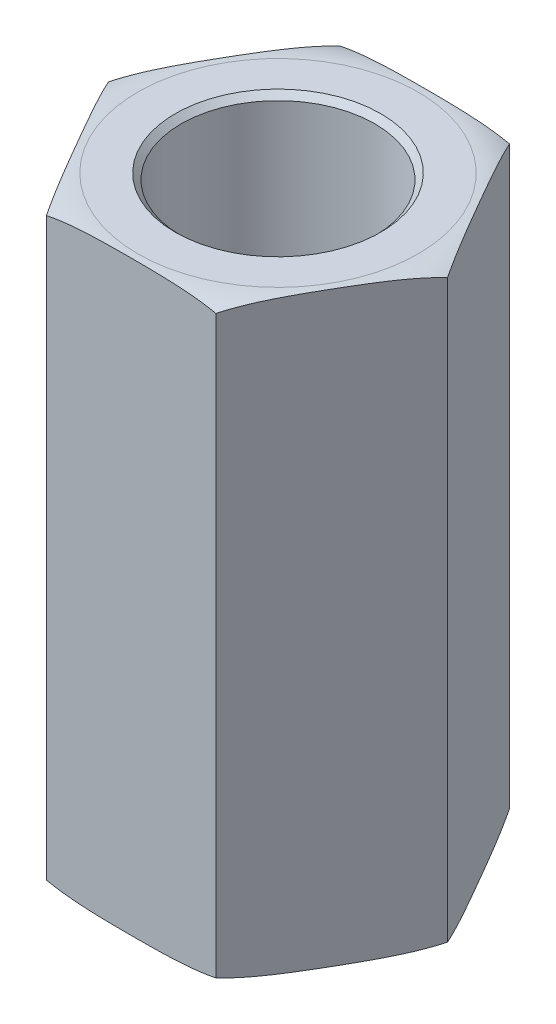
ISO-10303-21;
HEADER;
FILE_DESCRIPTION(('STEP AP214'),'2;1');
FILE_NAME('part.step','',(''),(''),'','','');
FILE_SCHEMA(('AUTOMOTIVE_DESIGN { 1 0 10303 214 1 1 1 1 }'));
ENDSEC;
DATA;
#1=APPLICATION_CONTEXT('core data for automotive mechanical design processes');
#2=APPLICATION_PROTOCOL_DEFINITION('international standard','automotive_design',2000,#1);
#3=PRODUCT_CONTEXT('',#1,'mechanical');
#4=PRODUCT('Part','Part','',(#3));
#5=PRODUCT_RELATED_PRODUCT_CATEGORY('part','',(#4));
#6=PRODUCT_DEFINITION_FORMATION('','',#4);
#7=PRODUCT_DEFINITION_CONTEXT('part definition',#1,'design');
#8=PRODUCT_DEFINITION('design','',#6,#7);
#9=PRODUCT_DEFINITION_SHAPE('','',#8);
#10=(LENGTH_UNIT() NAMED_UNIT(*) SI_UNIT(.MILLI.,.METRE.));
#11=(NAMED_UNIT(*) PLANE_ANGLE_UNIT() SI_UNIT($,.RADIAN.));
#12=(NAMED_UNIT(*) SI_UNIT($,.STERADIAN.) SOLID_ANGLE_UNIT());
#13=UNCERTAINTY_MEASURE_WITH_UNIT(LENGTH_MEASURE(1.E-05),#10,'distance_accuracy_value','');
#14=(GEOMETRIC_REPRESENTATION_CONTEXT(3) GLOBAL_UNCERTAINTY_ASSIGNED_CONTEXT((#13)) GLOBAL_UNIT_ASSIGNED_CONTEXT((#10,
#11,#12)) REPRESENTATION_CONTEXT('',''));
#15=CARTESIAN_POINT('',(0.,0.,0.));
#16=DIRECTION('',(0.,0.,1.));
#17=DIRECTION('',(1.,0.,0.));
#18=AXIS2_PLACEMENT_3D('',#15,#16,#17);
#19=CARTESIAN_POINT('',(3.66617420935412,6.35,0.));
#20=DIRECTION('',(-0.866025403784439,0.,0.5));
#21=DIRECTION('',(0.5,0.,0.866025403784439));
#22=AXIS2_PLACEMENT_3D('',#19,#20,#21);
#23=PLANE('',#22);
#24=CARTESIAN_POINT('',(3.66617420935412,6.223,0.));
#25=CARTESIAN_POINT('',(3.63753042799203,6.23493202468709,-0.0496124846400273));
#26=CARTESIAN_POINT('',(3.60875945805375,6.24555614694223,-0.0994452663561575));
#27=CARTESIAN_POINT('',(3.5510445941875,6.26452869380446,-0.199410342924434));
#28=CARTESIAN_POINT('',(3.52210079717004,6.27287829008084,-0.249542469922636));
#29=CARTESIAN_POINT('',(3.43520914920621,6.29501015084215,-0.400043218949385));
#30=CARTESIAN_POINT('',(3.37708055050429,6.30592253839952,-0.500724905273883));
#31=CARTESIAN_POINT('',(3.26070078255249,6.3225474670846,-0.70230057633948));
#32=CARTESIAN_POINT('',(3.20244972255356,6.32826351393611,-0.803194371852365));
#33=CARTESIAN_POINT('',(3.08586365366197,6.33654325238667,-1.00512736662734));
#34=CARTESIAN_POINT('',(3.02752861562773,6.3391051045623,-1.1061666163641));
#35=CARTESIAN_POINT('',(2.9113821383228,6.3424800878033,-1.30733821617637));
#36=CARTESIAN_POINT('',(2.85357078573452,6.34330898530758,-1.40747041611356));
#37=CARTESIAN_POINT('',(2.73795502274299,6.34390235146376,-1.60772279177073));
#38=CARTESIAN_POINT('',(2.68015061252641,6.34366697200316,-1.70784296716739));
#39=CARTESIAN_POINT('',(2.5645271384304,6.34193398748164,-1.90810869884931));
#40=CARTESIAN_POINT('',(2.50670807591217,6.34043597123025,-2.0082542527769));
#41=CARTESIAN_POINT('',(2.39109525560101,6.33517531674577,-2.20850153156215));
#42=CARTESIAN_POINT('',(2.33330149587797,6.33141290136093,-2.30860325976288));
#43=CARTESIAN_POINT('',(2.23849359853911,6.32198899303816,-2.47281535491257));
#44=CARTESIAN_POINT('',(2.20145192539195,6.31749057663767,-2.53697341480081));
#45=CARTESIAN_POINT('',(2.12747060706784,6.30630148199487,-2.66511281694908));
#46=CARTESIAN_POINT('',(2.09053091530161,6.2996120720916,-2.72909423990413));
#47=CARTESIAN_POINT('',(2.01669860633929,6.28339780386583,-2.85697555026699));
#48=CARTESIAN_POINT('',(1.97980639337021,6.27386525006224,-2.92087473753309));
#49=CARTESIAN_POINT('',(1.90623831426152,6.25126291445617,-3.04829838836459));
#50=CARTESIAN_POINT('',(1.86956287153406,6.23818767878213,-3.11182211855863));
#51=CARTESIAN_POINT('',(1.83308710467706,6.223,-3.175));
#52=B_SPLINE_CURVE_WITH_KNOTS('',3,(#24,#25,#26,#27,#28,#29,#30,#31,#32,#33,#34,#35,#36,#37,#38,
#39,#40,#41,#42,#43,#44,#45,#46,#47,#48,#49,#50,#51),.UNSPECIFIED.,.F.,.F.,(4,2,2,2,2,2,2,2,2,2,
2,2,2,4),(0.,0.17550946738822,0.350928353443244,0.701031261588485,1.05089779629355,
1.40096826525493,1.74783967758032,2.09466158796882,2.44159648808704,2.78849725058545,
3.01113198199941,3.23363806003512,3.45675194236245,3.68021127402553),.UNSPECIFIED.);
#53=CARTESIAN_POINT('',(3.66617420935412,6.223,0.));
#54=VERTEX_POINT('',#53);
#55=CARTESIAN_POINT('',(1.83308710467706,6.223,-3.175));
#56=VERTEX_POINT('',#55);
#57=EDGE_CURVE('E107',#54,#56,#52,.T.);
#58=ORIENTED_EDGE('',*,*,#57,.F.);
#59=DIRECTION('',(0.,1.,0.));
#60=VECTOR('',#59,1.);
#61=CARTESIAN_POINT('',(3.66617420935412,6.35,0.));
#62=LINE('',#61,#60);
#63=CARTESIAN_POINT('',(3.66617420935412,-6.223,0.));
#64=VERTEX_POINT('',#63);
#65=EDGE_CURVE('E80',#54,#64,#62,.F.);
#66=ORIENTED_EDGE('',*,*,#65,.T.);
#67=CARTESIAN_POINT('',(1.83308710467705,-6.223,-3.17500000000001));
#68=CARTESIAN_POINT('',(1.86173088603914,-6.23493202468708,-3.12538751535998));
#69=CARTESIAN_POINT('',(1.89050185597742,-6.24555614694223,-3.07555473364384));
#70=CARTESIAN_POINT('',(1.94821671984368,-6.26452869380445,-2.97558965707556));
#71=CARTESIAN_POINT('',(1.97716051686114,-6.27287829008084,-2.92545753007736));
#72=CARTESIAN_POINT('',(2.06405216482497,-6.29501015084215,-2.77495678105061));
#73=CARTESIAN_POINT('',(2.12218076352689,-6.30592253839952,-2.67427509472611));
#74=CARTESIAN_POINT('',(2.2385605314787,-6.3225474670846,-2.4726994236605));
#75=CARTESIAN_POINT('',(2.29681159147762,-6.32826351393611,-2.37180562814761));
#76=CARTESIAN_POINT('',(2.41339766036922,-6.33654325238667,-2.16987263337264));
#77=CARTESIAN_POINT('',(2.47173269840347,-6.3391051045623,-2.06883338363586));
#78=CARTESIAN_POINT('',(2.58787917570839,-6.3424800878033,-1.86766178382359));
#79=CARTESIAN_POINT('',(2.64569052829668,-6.34330898530758,-1.7675295838864));
#80=CARTESIAN_POINT('',(2.76130629128821,-6.34390235146376,-1.56727720822922));
#81=CARTESIAN_POINT('',(2.81911070150479,-6.34366697200316,-1.46715703283255));
#82=CARTESIAN_POINT('',(2.93473417560081,-6.34193398748164,-1.26689130115063));
#83=CARTESIAN_POINT('',(2.99255323811904,-6.34043597123025,-1.16674574722304));
#84=CARTESIAN_POINT('',(3.1081660584302,-6.33517531674576,-0.966498468437779));
#85=CARTESIAN_POINT('',(3.16595981815325,-6.33141290136092,-0.866396740237043));
#86=CARTESIAN_POINT('',(3.26076771549211,-6.32198899303815,-0.702184645087361));
#87=CARTESIAN_POINT('',(3.29780938863927,-6.31749057663767,-0.638026585199124));
#88=CARTESIAN_POINT('',(3.37179070696336,-6.30630148199486,-0.509887183050866));
#89=CARTESIAN_POINT('',(3.40873039872959,-6.2996120720916,-0.445905760095823));
#90=CARTESIAN_POINT('',(3.4825627076919,-6.28339780386583,-0.318024449732975));
#91=CARTESIAN_POINT('',(3.51945492066098,-6.27386525006224,-0.254125262466882));
#92=CARTESIAN_POINT('',(3.59302299976966,-6.25126291445617,-0.126701611635399));
#93=CARTESIAN_POINT('',(3.62969844249711,-6.23818767878213,-0.0631778814413663));
#94=CARTESIAN_POINT('',(3.66617420935412,-6.223,0.));
#95=B_SPLINE_CURVE_WITH_KNOTS('',3,(#67,#68,#69,#70,#71,#72,#73,#74,#75,#76,#77,#78,#79,#80,#81,
#82,#83,#84,#85,#86,#87,#88,#89,#90,#91,#92,#93,#94),.UNSPECIFIED.,.F.,.F.,(4,2,2,2,2,2,2,2,2,2,
2,2,2,4),(0.,0.175509467388227,0.350928353443257,0.701031261588509,1.05089779629358,
1.40096826525498,1.74783967758038,2.09466158796889,2.44159648808712,2.78849725058554,
3.01113198199948,3.23363806003517,3.45675194236248,3.68021127402553),.UNSPECIFIED.);
#96=CARTESIAN_POINT('',(1.83308710467705,-6.223,-3.175));
#97=VERTEX_POINT('',#96);
#98=EDGE_CURVE('E97',#97,#64,#95,.T.);
#99=ORIENTED_EDGE('',*,*,#98,.F.);
#100=DIRECTION('',(0.,1.,0.));
#101=VECTOR('',#100,1.);
#102=CARTESIAN_POINT('',(1.83308710467704,6.35,-3.175));
#103=LINE('',#102,#101);
#104=EDGE_CURVE('E111',#97,#56,#103,.T.);
#105=ORIENTED_EDGE('',*,*,#104,.T.);
#106=EDGE_LOOP('',(#58,#66,#99,#105));
#107=FACE_BOUND('',#106,.T.);
#108=ADVANCED_FACE('F17',(#107),#23,.F.);
#109=CARTESIAN_POINT('',(1.83308710467706,6.35,3.17499999999999));
#110=DIRECTION('',(-0.866025403784439,0.,-0.5));
#111=DIRECTION('',(-0.5,0.,0.866025403784439));
#112=AXIS2_PLACEMENT_3D('',#109,#110,#111);
#113=PLANE('',#112);
#114=CARTESIAN_POINT('',(1.83308710467706,6.223,3.17499999999999));
#115=CARTESIAN_POINT('',(1.86173088603915,6.23493202468709,3.12538751535996));
#116=CARTESIAN_POINT('',(1.89050185597743,6.24555614694223,3.07555473364383));
#117=CARTESIAN_POINT('',(1.94821671984368,6.26452869380446,2.97558965707556));
#118=CARTESIAN_POINT('',(1.97716051686114,6.27287829008084,2.92545753007736));
#119=CARTESIAN_POINT('',(2.06405216482498,6.29501015084215,2.77495678105061));
#120=CARTESIAN_POINT('',(2.12218076352689,6.30592253839952,2.67427509472611));
#121=CARTESIAN_POINT('',(2.23856053147869,6.3225474670846,2.47269942366051));
#122=CARTESIAN_POINT('',(2.29681159147762,6.32826351393611,2.37180562814763));
#123=CARTESIAN_POINT('',(2.41339766036922,6.33654325238667,2.16987263337266));
#124=CARTESIAN_POINT('',(2.47173269840346,6.3391051045623,2.06883338363589));
#125=CARTESIAN_POINT('',(2.58787917570838,6.3424800878033,1.86766178382362));
#126=CARTESIAN_POINT('',(2.64569052829666,6.34330898530758,1.76752958388643));
#127=CARTESIAN_POINT('',(2.76130629128819,6.34390235146376,1.56727720822926));
#128=CARTESIAN_POINT('',(2.81911070150477,6.34366697200316,1.46715703283259));
#129=CARTESIAN_POINT('',(2.93473417560078,6.34193398748164,1.26689130115068));
#130=CARTESIAN_POINT('',(2.99255323811902,6.34043597123025,1.16674574722309));
#131=CARTESIAN_POINT('',(3.10816605843017,6.33517531674577,0.966498468437838));
#132=CARTESIAN_POINT('',(3.16595981815321,6.33141290136093,0.866396740237105));
#133=CARTESIAN_POINT('',(3.26076771549208,6.32198899303816,0.702184645087422));
#134=CARTESIAN_POINT('',(3.29780938863924,6.31749057663767,0.638026585199181));
#135=CARTESIAN_POINT('',(3.37179070696334,6.30630148199487,0.509887183050912));
#136=CARTESIAN_POINT('',(3.40873039872957,6.2996120720916,0.445905760095864));
#137=CARTESIAN_POINT('',(3.48256270769189,6.28339780386583,0.318024449733006));
#138=CARTESIAN_POINT('',(3.51945492066097,6.27386525006224,0.254125262466908));
#139=CARTESIAN_POINT('',(3.59302299976965,6.25126291445617,0.126701611635414));
#140=CARTESIAN_POINT('',(3.62969844249711,6.23818767878213,0.0631778814413764));
#141=CARTESIAN_POINT('',(3.66617420935412,6.223,0.));
#142=B_SPLINE_CURVE_WITH_KNOTS('',3,(#114,#115,#116,#117,#118,#119,#120,#121,#122,#123,#124,
#125,#126,#127,#128,#129,#130,#131,#132,#133,#134,#135,#136,#137,#138,#139,#140,#141),
.UNSPECIFIED.,.F.,.F.,(4,2,2,2,2,2,2,2,2,2,2,2,2,4),(0.,0.175509467388221,0.350928353443245,
0.701031261588486,1.05089779629355,1.40096826525493,1.74783967758032,2.09466158796882,
2.44159648808704,2.78849725058545,3.0111319819994,3.23363806003511,3.45675194236244,
3.68021127402551),.UNSPECIFIED.);
#143=CARTESIAN_POINT('',(1.83308710467706,6.223,3.17499999999999));
#144=VERTEX_POINT('',#143);
#145=EDGE_CURVE('E22',#144,#54,#142,.T.);
#146=ORIENTED_EDGE('',*,*,#145,.F.);
#147=DIRECTION('',(0.,1.,0.));
#148=VECTOR('',#147,1.);
#149=CARTESIAN_POINT('',(1.83308710467706,6.35,3.17499999999999));
#150=LINE('',#149,#148);
#151=CARTESIAN_POINT('',(1.83308710467706,-6.223,3.17499999999999));
#152=VERTEX_POINT('',#151);
#153=EDGE_CURVE('E100',#144,#152,#150,.F.);
#154=ORIENTED_EDGE('',*,*,#153,.T.);
#155=CARTESIAN_POINT('',(3.66617420935412,-6.223,0.));
#156=CARTESIAN_POINT('',(3.63753042799203,-6.23493202468709,0.0496124846400355));
#157=CARTESIAN_POINT('',(3.60875945805375,-6.24555614694223,0.0994452663561683));
#158=CARTESIAN_POINT('',(3.55104459418749,-6.26452869380446,0.19941034292445));
#159=CARTESIAN_POINT('',(3.52210079717003,-6.27287829008084,0.249542469922655));
#160=CARTESIAN_POINT('',(3.43520914920619,-6.29501015084215,0.400043218949413));
#161=CARTESIAN_POINT('',(3.37708055050427,-6.30592253839952,0.500724905273916));
#162=CARTESIAN_POINT('',(3.26070078255247,-6.3225474670846,0.702300576339523));
#163=CARTESIAN_POINT('',(3.20244972255354,-6.32826351393611,0.803194371852414));
#164=CARTESIAN_POINT('',(3.08586365366193,-6.33654325238667,1.0051273666274));
#165=CARTESIAN_POINT('',(3.02752861562769,-6.3391051045623,1.10616661636417));
#166=CARTESIAN_POINT('',(2.91138213832276,-6.3424800878033,1.30733821617645));
#167=CARTESIAN_POINT('',(2.85357078573448,-6.34330898530758,1.40747041611364));
#168=CARTESIAN_POINT('',(2.73795502274294,-6.34390235146376,1.60772279177082));
#169=CARTESIAN_POINT('',(2.68015061252636,-6.34366697200316,1.70784296716749));
#170=CARTESIAN_POINT('',(2.56452713843034,-6.34193398748164,1.90810869884942));
#171=CARTESIAN_POINT('',(2.5067080759121,-6.34043597123025,2.00825425277701));
#172=CARTESIAN_POINT('',(2.39109525560094,-6.33517531674576,2.20850153156228));
#173=CARTESIAN_POINT('',(2.3333014958779,-6.33141290136092,2.30860325976302));
#174=CARTESIAN_POINT('',(2.23849359853904,-6.32198899303815,2.47281535491269));
#175=CARTESIAN_POINT('',(2.20145192539188,-6.31749057663766,2.53697341480092));
#176=CARTESIAN_POINT('',(2.1274706070678,-6.30630148199486,2.66511281694917));
#177=CARTESIAN_POINT('',(2.09053091530157,-6.29961207209159,2.72909423990421));
#178=CARTESIAN_POINT('',(2.01669860633926,-6.28339780386582,2.85697555026704));
#179=CARTESIAN_POINT('',(1.97980639337019,-6.27386525006223,2.92087473753313));
#180=CARTESIAN_POINT('',(1.90623831426151,-6.25126291445617,3.0482983883646));
#181=CARTESIAN_POINT('',(1.86956287153406,-6.23818767878213,3.11182211855863));
#182=CARTESIAN_POINT('',(1.83308710467706,-6.223,3.17499999999999));
#183=B_SPLINE_CURVE_WITH_KNOTS('',3,(#155,#156,#157,#158,#159,#160,#161,#162,#163,#164,#165,
#166,#167,#168,#169,#170,#171,#172,#173,#174,#175,#176,#177,#178,#179,#180,#181,#182),
.UNSPECIFIED.,.F.,.F.,(4,2,2,2,2,2,2,2,2,2,2,2,2,4),(0.,0.17550946738823,0.350928353443263,
0.701031261588523,1.0508977962936,1.40096826525501,1.74783967758041,2.09466158796894,
2.44159648808717,2.7884972505856,3.01113198199951,3.23363806003518,3.45675194236248,
3.68021127402551),.UNSPECIFIED.);
#184=EDGE_CURVE('E205',#64,#152,#183,.T.);
#185=ORIENTED_EDGE('',*,*,#184,.F.);
#186=ORIENTED_EDGE('',*,*,#65,.F.);
#187=EDGE_LOOP('',(#146,#154,#185,#186));
#188=FACE_BOUND('',#187,.T.);
#189=ADVANCED_FACE('F106',(#188),#113,.F.);
#190=CARTESIAN_POINT('',(-1.83308710467707,6.35,3.175));
#191=DIRECTION('',(0.,0.,-1.));
#192=DIRECTION('',(-1.,0.,0.));
#193=AXIS2_PLACEMENT_3D('',#190,#191,#192);
#194=PLANE('',#193);
#195=ORIENTED_EDGE('',*,*,#153,.F.);
#196=CARTESIAN_POINT('',(-1.83308710467707,6.223,3.175));
#197=CARTESIAN_POINT('',(-1.75760871054776,6.23871230122365,3.175));
#198=CARTESIAN_POINT('',(-1.68170571468658,6.2521647800808,3.175));
#199=CARTESIAN_POINT('',(-1.52939807527773,6.27530486470105,3.175));
#200=CARTESIAN_POINT('',(-1.45299400110163,6.28499617502722,3.175));
#201=CARTESIAN_POINT('',(-1.30011823209763,6.30137135267138,3.175));
#202=CARTESIAN_POINT('',(-1.22364747610196,6.30806442247852,3.175));
#203=CARTESIAN_POINT('',(-1.07052459410173,6.31917241699752,3.175));
#204=CARTESIAN_POINT('',(-0.993872424115957,6.32358671655425,3.175));
#205=CARTESIAN_POINT('',(-0.840856910195846,6.33072419802798,3.175));
#206=CARTESIAN_POINT('',(-0.764493913329282,6.33345527367792,3.175));
#207=CARTESIAN_POINT('',(-0.611734616938516,6.33775632258003,3.175));
#208=CARTESIAN_POINT('',(-0.535338316331409,6.33932625473883,3.175));
#209=CARTESIAN_POINT('',(-0.38245423122642,6.34168247076567,3.175));
#210=CARTESIAN_POINT('',(-0.305966435115039,6.34246792759644,3.175));
#211=CARTESIAN_POINT('',(-0.152985759387013,6.34348841069004,3.175));
#212=CARTESIAN_POINT('',(-0.0764928796935063,6.3437234241492,3.175));
#213=CARTESIAN_POINT('',(0.0764928796935061,6.3437234241492,3.175));
#214=CARTESIAN_POINT('',(0.152985759387012,6.34348841069004,3.17499999999999));
#215=CARTESIAN_POINT('',(0.305966435115038,6.34246792759644,3.17499999999999));
#216=CARTESIAN_POINT('',(0.382454231226419,6.34168247076567,3.17499999999999));
#217=CARTESIAN_POINT('',(0.535338316331408,6.33932625473883,3.17499999999999));
#218=CARTESIAN_POINT('',(0.611734616938515,6.33775632258003,3.17499999999999));
#219=CARTESIAN_POINT('',(0.76449391332928,6.33345527367792,3.17499999999999));
#220=CARTESIAN_POINT('',(0.840856910195844,6.33072419802798,3.17499999999999));
#221=CARTESIAN_POINT('',(0.993872424115954,6.32358671655425,3.17499999999999));
#222=CARTESIAN_POINT('',(1.07052459410172,6.31917241699752,3.17499999999999));
#223=CARTESIAN_POINT('',(1.22364747610196,6.30806442247852,3.17499999999999));
#224=CARTESIAN_POINT('',(1.30011823209763,6.30137135267139,3.17499999999999));
#225=CARTESIAN_POINT('',(1.45299400110163,6.28499617502722,3.17499999999999));
#226=CARTESIAN_POINT('',(1.52939807527773,6.27530486470105,3.17499999999999));
#227=CARTESIAN_POINT('',(1.68170571468658,6.25216478008081,3.17499999999999));
#228=CARTESIAN_POINT('',(1.75760871054776,6.23871230122365,3.17499999999999));
#229=CARTESIAN_POINT('',(1.83308710467706,6.223,3.17499999999999));
#230=B_SPLINE_CURVE_WITH_KNOTS('',3,(#196,#197,#198,#199,#200,#201,#202,#203,#204,#205,#206,
#207,#208,#209,#210,#211,#212,#213,#214,#215,#216,#217,#218,#219,#220,#221,#222,#223,#224,#225,
#226,#227,#228,#229),.UNSPECIFIED.,.F.,.F.,(4,2,2,2,2,2,2,2,2,2,2,2,2,2,2,2,4),(0.,
0.23119079437731,0.46215329593589,0.692401964780505,0.922713766248053,1.15193709952408,
1.3811685447265,1.61064140410055,1.84011960111017,2.06959779811978,2.29907065749383,
2.52830210269625,2.75752543597228,2.98783723743982,3.21808590628444,3.44904840784302,
3.68023920222033),.UNSPECIFIED.);
#231=CARTESIAN_POINT('',(-1.83308710467707,6.223,3.175));
#232=VERTEX_POINT('',#231);
#233=EDGE_CURVE('E86',#232,#144,#230,.T.);
#234=ORIENTED_EDGE('',*,*,#233,.F.);
#235=DIRECTION('',(0.,1.,0.));
#236=VECTOR('',#235,1.);
#237=CARTESIAN_POINT('',(-1.83308710467707,6.35,3.175));
#238=LINE('',#237,#236);
#239=CARTESIAN_POINT('',(-1.83308710467707,-6.223,3.175));
#240=VERTEX_POINT('',#239);
#241=EDGE_CURVE('E104',#232,#240,#238,.F.);
#242=ORIENTED_EDGE('',*,*,#241,.T.);
#243=CARTESIAN_POINT('',(1.83308710467706,-6.223,3.17499999999999));
#244=CARTESIAN_POINT('',(1.75760871054776,-6.23871230122365,3.17499999999999));
#245=CARTESIAN_POINT('',(1.68170571468658,-6.25216478008081,3.17499999999999));
#246=CARTESIAN_POINT('',(1.52939807527773,-6.27530486470105,3.17499999999999));
#247=CARTESIAN_POINT('',(1.45299400110163,-6.28499617502722,3.17499999999999));
#248=CARTESIAN_POINT('',(1.30011823209763,-6.30137135267139,3.17499999999999));
#249=CARTESIAN_POINT('',(1.22364747610196,-6.30806442247852,3.17499999999999));
#250=CARTESIAN_POINT('',(1.07052459410172,-6.31917241699752,3.17499999999999));
#251=CARTESIAN_POINT('',(0.993872424115954,-6.32358671655425,3.17499999999999));
#252=CARTESIAN_POINT('',(0.840856910195844,-6.33072419802799,3.17499999999999));
#253=CARTESIAN_POINT('',(0.76449391332928,-6.33345527367792,3.17499999999999));
#254=CARTESIAN_POINT('',(0.611734616938515,-6.33775632258003,3.17499999999999));
#255=CARTESIAN_POINT('',(0.535338316331408,-6.33932625473883,3.17499999999999));
#256=CARTESIAN_POINT('',(0.382454231226419,-6.34168247076568,3.17499999999999));
#257=CARTESIAN_POINT('',(0.305966435115038,-6.34246792759644,3.17499999999999));
#258=CARTESIAN_POINT('',(0.152985759387012,-6.34348841069004,3.17499999999999));
#259=CARTESIAN_POINT('',(0.0764928796935062,-6.3437234241492,3.175));
#260=CARTESIAN_POINT('',(-0.076492879693506,-6.3437234241492,3.175));
#261=CARTESIAN_POINT('',(-0.152985759387012,-6.34348841069004,3.175));
#262=CARTESIAN_POINT('',(-0.305966435115038,-6.34246792759644,3.175));
#263=CARTESIAN_POINT('',(-0.382454231226419,-6.34168247076568,3.175));
#264=CARTESIAN_POINT('',(-0.535338316331408,-6.33932625473883,3.175));
#265=CARTESIAN_POINT('',(-0.611734616938515,-6.33775632258003,3.175));
#266=CARTESIAN_POINT('',(-0.76449391332928,-6.33345527367792,3.175));
#267=CARTESIAN_POINT('',(-0.840856910195844,-6.33072419802798,3.175));
#268=CARTESIAN_POINT('',(-0.993872424115955,-6.32358671655425,3.175));
#269=CARTESIAN_POINT('',(-1.07052459410172,-6.31917241699752,3.175));
#270=CARTESIAN_POINT('',(-1.22364747610196,-6.30806442247852,3.175));
#271=CARTESIAN_POINT('',(-1.30011823209763,-6.30137135267139,3.175));
#272=CARTESIAN_POINT('',(-1.45299400110163,-6.28499617502722,3.175));
#273=CARTESIAN_POINT('',(-1.52939807527773,-6.27530486470105,3.175));
#274=CARTESIAN_POINT('',(-1.68170571468658,-6.2521647800808,3.175));
#275=CARTESIAN_POINT('',(-1.75760871054776,-6.23871230122365,3.175));
#276=CARTESIAN_POINT('',(-1.83308710467706,-6.223,3.175));
#277=B_SPLINE_CURVE_WITH_KNOTS('',3,(#243,#244,#245,#246,#247,#248,#249,#250,#251,#252,#253,
#254,#255,#256,#257,#258,#259,#260,#261,#262,#263,#264,#265,#266,#267,#268,#269,#270,#271,#272,
#273,#274,#275,#276),.UNSPECIFIED.,.F.,.F.,(4,2,2,2,2,2,2,2,2,2,2,2,2,2,2,2,4),(0.,
0.23119079437731,0.462153295935889,0.692401964780502,0.92271376624805,1.15193709952407,
1.3811685447265,1.61064140410055,1.84011960111016,2.06959779811977,2.29907065749383,
2.52830210269625,2.75752543597227,2.98783723743982,3.21808590628443,3.44904840784301,
3.68023920222032),.UNSPECIFIED.);
#278=EDGE_CURVE('E102',#152,#240,#277,.T.);
#279=ORIENTED_EDGE('',*,*,#278,.F.);
#280=EDGE_LOOP('',(#195,#234,#242,#279));
#281=FACE_BOUND('',#280,.T.);
#282=ADVANCED_FACE('F101',(#281),#194,.F.);
#283=CARTESIAN_POINT('',(-3.66617420935413,6.35,0.));
#284=DIRECTION('',(0.866025403784439,0.,-0.499999999999999));
#285=DIRECTION('',(-0.499999999999999,0.,-0.866025403784439));
#286=AXIS2_PLACEMENT_3D('',#283,#284,#285);
#287=PLANE('',#286);
#288=CARTESIAN_POINT('',(-3.66617420935412,6.223,0.));
#289=CARTESIAN_POINT('',(-3.63753042799204,6.23493202468708,0.0496124846400287));
#290=CARTESIAN_POINT('',(-3.60875945805376,6.24555614694223,0.0994452663561603));
#291=CARTESIAN_POINT('',(-3.5510445941875,6.26452869380446,0.199410342924439));
#292=CARTESIAN_POINT('',(-3.52210079717004,6.27287829008084,0.249542469922643));
#293=CARTESIAN_POINT('',(-3.43520914920621,6.29501015084215,0.400043218949397));
#294=CARTESIAN_POINT('',(-3.37708055050429,6.30592253839952,0.500724905273897));
#295=CARTESIAN_POINT('',(-3.26070078255249,6.3225474670846,0.702300576339499));
#296=CARTESIAN_POINT('',(-3.20244972255356,6.32826351393611,0.803194371852387));
#297=CARTESIAN_POINT('',(-3.08586365366196,6.33654325238667,1.00512736662736));
#298=CARTESIAN_POINT('',(-3.02752861562771,6.3391051045623,1.10616661636413));
#299=CARTESIAN_POINT('',(-2.91138213832279,6.3424800878033,1.30733821617641));
#300=CARTESIAN_POINT('',(-2.85357078573451,6.34330898530758,1.4074704161136));
#301=CARTESIAN_POINT('',(-2.73795502274297,6.34390235146376,1.60772279177078));
#302=CARTESIAN_POINT('',(-2.68015061252639,6.34366697200316,1.70784296716744));
#303=CARTESIAN_POINT('',(-2.56452713843038,6.34193398748164,1.90810869884937));
#304=CARTESIAN_POINT('',(-2.50670807591214,6.34043597123025,2.00825425277695));
#305=CARTESIAN_POINT('',(-2.39109525560098,6.33517531674576,2.20850153156221));
#306=CARTESIAN_POINT('',(-2.33330149587794,6.33141290136092,2.30860325976295));
#307=CARTESIAN_POINT('',(-2.23849359853908,6.32198899303815,2.47281535491263));
#308=CARTESIAN_POINT('',(-2.20145192539192,6.31749057663767,2.53697341480087));
#309=CARTESIAN_POINT('',(-2.12747060706783,6.30630148199486,2.66511281694913));
#310=CARTESIAN_POINT('',(-2.0905309153016,6.2996120720916,2.72909423990417));
#311=CARTESIAN_POINT('',(-2.01669860633929,6.28339780386583,2.85697555026702));
#312=CARTESIAN_POINT('',(-1.97980639337021,6.27386525006224,2.92087473753311));
#313=CARTESIAN_POINT('',(-1.90623831426153,6.25126291445617,3.0482983883646));
#314=CARTESIAN_POINT('',(-1.86956287153407,6.23818767878213,3.11182211855863));
#315=CARTESIAN_POINT('',(-1.83308710467707,6.223,3.175));
#316=B_SPLINE_CURVE_WITH_KNOTS('',3,(#288,#289,#290,#291,#292,#293,#294,#295,#296,#297,#298,
#299,#300,#301,#302,#303,#304,#305,#306,#307,#308,#309,#310,#311,#312,#313,#314,#315),
.UNSPECIFIED.,.F.,.F.,(4,2,2,2,2,2,2,2,2,2,2,2,2,4),(0.,0.175509467388225,0.350928353443254,
0.701031261588504,1.05089779629357,1.40096826525497,1.74783967758037,2.09466158796888,
2.44159648808711,2.78849725058552,3.01113198199946,3.23363806003515,3.45675194236247,
3.68021127402552),.UNSPECIFIED.);
#317=CARTESIAN_POINT('',(-3.66617420935413,6.223,0.));
#318=VERTEX_POINT('',#317);
#319=EDGE_CURVE('E94',#318,#232,#316,.T.);
#320=ORIENTED_EDGE('',*,*,#319,.F.);
#321=DIRECTION('',(0.,1.,0.));
#322=VECTOR('',#321,1.);
#323=CARTESIAN_POINT('',(-3.66617420935413,6.35,0.));
#324=LINE('',#323,#322);
#325=CARTESIAN_POINT('',(-3.66617420935413,-6.223,0.));
#326=VERTEX_POINT('',#325);
#327=EDGE_CURVE('E118',#318,#326,#324,.F.);
#328=ORIENTED_EDGE('',*,*,#327,.T.);
#329=CARTESIAN_POINT('',(-1.83308710467707,-6.223,3.175));
#330=CARTESIAN_POINT('',(-1.86173088603915,-6.23493202468708,3.12538751535997));
#331=CARTESIAN_POINT('',(-1.89050185597743,-6.24555614694223,3.07555473364384));
#332=CARTESIAN_POINT('',(-1.94821671984368,-6.26452869380445,2.97558965707557));
#333=CARTESIAN_POINT('',(-1.97716051686114,-6.27287829008083,2.92545753007737));
#334=CARTESIAN_POINT('',(-2.06405216482498,-6.29501015084215,2.77495678105062));
#335=CARTESIAN_POINT('',(-2.12218076352689,-6.30592253839952,2.67427509472613));
#336=CARTESIAN_POINT('',(-2.23856053147869,-6.3225474670846,2.47269942366053));
#337=CARTESIAN_POINT('',(-2.29681159147761,-6.32826351393611,2.37180562814765));
#338=CARTESIAN_POINT('',(-2.41339766036921,-6.33654325238667,2.16987263337269));
#339=CARTESIAN_POINT('',(-2.47173269840345,-6.3391051045623,2.06883338363592));
#340=CARTESIAN_POINT('',(-2.58787917570836,-6.3424800878033,1.86766178382365));
#341=CARTESIAN_POINT('',(-2.64569052829664,-6.34330898530758,1.76752958388647));
#342=CARTESIAN_POINT('',(-2.76130629128817,-6.34390235146376,1.5672772082293));
#343=CARTESIAN_POINT('',(-2.81911070150475,-6.34366697200316,1.46715703283264));
#344=CARTESIAN_POINT('',(-2.93473417560076,-6.34193398748164,1.26689130115073));
#345=CARTESIAN_POINT('',(-2.99255323811899,-6.34043597123025,1.16674574722315));
#346=CARTESIAN_POINT('',(-3.10816605843015,-6.33517531674577,0.966498468437894));
#347=CARTESIAN_POINT('',(-3.16595981815318,-6.33141290136093,0.866396740237163));
#348=CARTESIAN_POINT('',(-3.26076771549205,-6.32198899303816,0.702184645087477));
#349=CARTESIAN_POINT('',(-3.29780938863921,-6.31749057663768,0.63802658519923));
#350=CARTESIAN_POINT('',(-3.37179070696332,-6.30630148199487,0.509887183050951));
#351=CARTESIAN_POINT('',(-3.40873039872955,-6.29961207209161,0.445905760095898));
#352=CARTESIAN_POINT('',(-3.48256270769188,-6.28339780386583,0.318024449733029));
#353=CARTESIAN_POINT('',(-3.51945492066096,-6.27386525006224,0.254125262466926));
#354=CARTESIAN_POINT('',(-3.59302299976965,-6.25126291445617,0.126701611635421));
#355=CARTESIAN_POINT('',(-3.62969844249711,-6.23818767878213,0.0631778814413781));
#356=CARTESIAN_POINT('',(-3.66617420935412,-6.223,0.));
#357=B_SPLINE_CURVE_WITH_KNOTS('',3,(#329,#330,#331,#332,#333,#334,#335,#336,#337,#338,#339,
#340,#341,#342,#343,#344,#345,#346,#347,#348,#349,#350,#351,#352,#353,#354,#355,#356),
.UNSPECIFIED.,.F.,.F.,(4,2,2,2,2,2,2,2,2,2,2,2,2,4),(0.,0.175509467388216,0.350928353443237,
0.701031261588471,1.05089779629352,1.4009682652549,1.74783967758028,2.09466158796878,
2.44159648808698,2.78849725058539,3.01113198199936,3.23363806003508,3.45675194236244,
3.68021127402552),.UNSPECIFIED.);
#358=EDGE_CURVE('E196',#240,#326,#357,.T.);
#359=ORIENTED_EDGE('',*,*,#358,.F.);
#360=ORIENTED_EDGE('',*,*,#241,.F.);
#361=EDGE_LOOP('',(#320,#328,#359,#360));
#362=FACE_BOUND('',#361,.T.);
#363=ADVANCED_FACE('F190',(#362),#287,.F.);
#364=CARTESIAN_POINT('',(-1.83308710467707,6.35,-3.175));
#365=DIRECTION('',(0.866025403784439,0.,0.5));
#366=DIRECTION('',(0.5,0.,-0.866025403784439));
#367=AXIS2_PLACEMENT_3D('',#364,#365,#366);
#368=PLANE('',#367);
#369=CARTESIAN_POINT('',(-1.83308710467706,6.223,-3.17500000000001));
#370=CARTESIAN_POINT('',(-1.86173088603915,6.23493202468708,-3.12538751535998));
#371=CARTESIAN_POINT('',(-1.89050185597743,6.24555614694223,-3.07555473364385));
#372=CARTESIAN_POINT('',(-1.94821671984368,6.26452869380445,-2.97558965707557));
#373=CARTESIAN_POINT('',(-1.97716051686114,6.27287829008083,-2.92545753007737));
#374=CARTESIAN_POINT('',(-2.06405216482498,6.29501015084215,-2.77495678105062));
#375=CARTESIAN_POINT('',(-2.12218076352689,6.30592253839952,-2.67427509472612));
#376=CARTESIAN_POINT('',(-2.2385605314787,6.3225474670846,-2.47269942366052));
#377=CARTESIAN_POINT('',(-2.29681159147762,6.32826351393611,-2.37180562814763));
#378=CARTESIAN_POINT('',(-2.41339766036922,6.33654325238667,-2.16987263337266));
#379=CARTESIAN_POINT('',(-2.47173269840346,6.3391051045623,-2.06883338363589));
#380=CARTESIAN_POINT('',(-2.58787917570839,6.3424800878033,-1.86766178382362));
#381=CARTESIAN_POINT('',(-2.64569052829667,6.34330898530758,-1.76752958388643));
#382=CARTESIAN_POINT('',(-2.7613062912882,6.34390235146376,-1.56727720822926));
#383=CARTESIAN_POINT('',(-2.81911070150478,6.34366697200316,-1.46715703283259));
#384=CARTESIAN_POINT('',(-2.93473417560079,6.34193398748164,-1.26689130115067));
#385=CARTESIAN_POINT('',(-2.99255323811903,6.34043597123025,-1.16674574722309));
#386=CARTESIAN_POINT('',(-3.10816605843019,6.33517531674577,-0.966498468437829));
#387=CARTESIAN_POINT('',(-3.16595981815323,6.33141290136093,-0.866396740237095));
#388=CARTESIAN_POINT('',(-3.26076771549209,6.32198899303815,-0.702184645087411));
#389=CARTESIAN_POINT('',(-3.29780938863925,6.31749057663767,-0.63802658519917));
#390=CARTESIAN_POINT('',(-3.37179070696335,6.30630148199487,-0.509887183050903));
#391=CARTESIAN_POINT('',(-3.40873039872958,6.2996120720916,-0.445905760095856));
#392=CARTESIAN_POINT('',(-3.4825627076919,6.28339780386583,-0.318024449733));
#393=CARTESIAN_POINT('',(-3.51945492066098,6.27386525006224,-0.254125262466903));
#394=CARTESIAN_POINT('',(-3.59302299976966,6.25126291445617,-0.126701611635411));
#395=CARTESIAN_POINT('',(-3.62969844249712,6.23818767878213,-0.0631778814413743));
#396=CARTESIAN_POINT('',(-3.66617420935413,6.223,0.));
#397=B_SPLINE_CURVE_WITH_KNOTS('',3,(#369,#370,#371,#372,#373,#374,#375,#376,#377,#378,#379,
#380,#381,#382,#383,#384,#385,#386,#387,#388,#389,#390,#391,#392,#393,#394,#395,#396),
.UNSPECIFIED.,.F.,.F.,(4,2,2,2,2,2,2,2,2,2,2,2,2,4),(0.,0.175509467388222,0.350928353443249,
0.701031261588494,1.05089779629356,1.40096826525495,1.74783967758034,2.09466158796885,
2.44159648808707,2.78849725058548,3.01113198199943,3.23363806003514,3.45675194236247,
3.68021127402553),.UNSPECIFIED.);
#398=CARTESIAN_POINT('',(-1.83308710467706,6.223,-3.175));
#399=VERTEX_POINT('',#398);
#400=EDGE_CURVE('E166',#399,#318,#397,.T.);
#401=ORIENTED_EDGE('',*,*,#400,.F.);
#402=DIRECTION('',(0.,1.,0.));
#403=VECTOR('',#402,1.);
#404=CARTESIAN_POINT('',(-1.83308710467706,6.35,-3.175));
#405=LINE('',#404,#403);
#406=CARTESIAN_POINT('',(-1.83308710467707,-6.223,-3.175));
#407=VERTEX_POINT('',#406);
#408=EDGE_CURVE('E108',#399,#407,#405,.F.);
#409=ORIENTED_EDGE('',*,*,#408,.T.);
#410=CARTESIAN_POINT('',(-3.66617420935413,-6.223,0.));
#411=CARTESIAN_POINT('',(-3.63753042799204,-6.23493202468708,-0.049612484640031));
#412=CARTESIAN_POINT('',(-3.60875945805377,-6.24555614694223,-0.0994452663561602));
#413=CARTESIAN_POINT('',(-3.55104459418751,-6.26452869380445,-0.199410342924434));
#414=CARTESIAN_POINT('',(-3.52210079717005,-6.27287829008083,-0.249542469922636));
#415=CARTESIAN_POINT('',(-3.43520914920622,-6.29501015084215,-0.400043218949382));
#416=CARTESIAN_POINT('',(-3.37708055050431,-6.30592253839952,-0.500724905273878));
#417=CARTESIAN_POINT('',(-3.26070078255251,-6.3225474670846,-0.70230057633947));
#418=CARTESIAN_POINT('',(-3.20244972255358,-6.32826351393611,-0.803194371852353));
#419=CARTESIAN_POINT('',(-3.08586365366199,-6.33654325238667,-1.00512736662732));
#420=CARTESIAN_POINT('',(-3.02752861562775,-6.3391051045623,-1.10616661636409));
#421=CARTESIAN_POINT('',(-2.91138213832283,-6.3424800878033,-1.30733821617635));
#422=CARTESIAN_POINT('',(-2.85357078573455,-6.34330898530758,-1.40747041611353));
#423=CARTESIAN_POINT('',(-2.73795502274302,-6.34390235146376,-1.6077227917707));
#424=CARTESIAN_POINT('',(-2.68015061252644,-6.34366697200316,-1.70784296716737));
#425=CARTESIAN_POINT('',(-2.56452713843043,-6.34193398748164,-1.90810869884928));
#426=CARTESIAN_POINT('',(-2.5067080759122,-6.34043597123025,-2.00825425277686));
#427=CARTESIAN_POINT('',(-2.39109525560104,-6.33517531674577,-2.20850153156211));
#428=CARTESIAN_POINT('',(-2.333301495878,-6.33141290136093,-2.30860325976284));
#429=CARTESIAN_POINT('',(-2.23849359853914,-6.32198899303816,-2.47281535491253));
#430=CARTESIAN_POINT('',(-2.20145192539198,-6.31749057663768,-2.53697341480078));
#431=CARTESIAN_POINT('',(-2.12747060706787,-6.30630148199487,-2.66511281694906));
#432=CARTESIAN_POINT('',(-2.09053091530164,-6.29961207209161,-2.72909423990411));
#433=CARTESIAN_POINT('',(-2.01669860633931,-6.28339780386583,-2.85697555026698));
#434=CARTESIAN_POINT('',(-1.97980639337023,-6.27386525006224,-2.92087473753308));
#435=CARTESIAN_POINT('',(-1.90623831426154,-6.25126291445617,-3.04829838836458));
#436=CARTESIAN_POINT('',(-1.86956287153408,-6.23818767878213,-3.11182211855862));
#437=CARTESIAN_POINT('',(-1.83308710467707,-6.223,-3.175));
#438=B_SPLINE_CURVE_WITH_KNOTS('',3,(#410,#411,#412,#413,#414,#415,#416,#417,#418,#419,#420,
#421,#422,#423,#424,#425,#426,#427,#428,#429,#430,#431,#432,#433,#434,#435,#436,#437),
.UNSPECIFIED.,.F.,.F.,(4,2,2,2,2,2,2,2,2,2,2,2,2,4),(0.,0.175509467388217,0.350928353443238,
0.701031261588472,1.05089779629353,1.40096826525491,1.74783967758028,2.09466158796878,
2.44159648808699,2.78849725058539,3.01113198199936,3.23363806003509,3.45675194236244,
3.68021127402552),.UNSPECIFIED.);
#439=EDGE_CURVE('E142',#326,#407,#438,.T.);
#440=ORIENTED_EDGE('',*,*,#439,.F.);
#441=ORIENTED_EDGE('',*,*,#327,.F.);
#442=EDGE_LOOP('',(#401,#409,#440,#441));
#443=FACE_BOUND('',#442,.T.);
#444=ADVANCED_FACE('F152',(#443),#368,.F.);
#445=CARTESIAN_POINT('',(1.83308710467706,6.35,-3.175));
#446=DIRECTION('',(0.,0.,1.));
#447=DIRECTION('',(1.,0.,0.));
#448=AXIS2_PLACEMENT_3D('',#445,#446,#447);
#449=PLANE('',#448);
#450=CARTESIAN_POINT('',(1.83308710467706,6.223,-3.175));
#451=CARTESIAN_POINT('',(1.75760871054775,6.23871230122365,-3.175));
#452=CARTESIAN_POINT('',(1.68170571468657,6.2521647800808,-3.175));
#453=CARTESIAN_POINT('',(1.52939807527772,6.27530486470105,-3.175));
#454=CARTESIAN_POINT('',(1.45299400110162,6.28499617502722,-3.175));
#455=CARTESIAN_POINT('',(1.30011823209763,6.30137135267138,-3.175));
#456=CARTESIAN_POINT('',(1.22364747610195,6.30806442247852,-3.175));
#457=CARTESIAN_POINT('',(1.07052459410172,6.31917241699751,-3.175));
#458=CARTESIAN_POINT('',(0.99387242411595,6.32358671655425,-3.175));
#459=CARTESIAN_POINT('',(0.840856910195841,6.33072419802798,-3.175));
#460=CARTESIAN_POINT('',(0.764493913329277,6.33345527367791,-3.175));
#461=CARTESIAN_POINT('',(0.611734616938512,6.33775632258003,-3.175));
#462=CARTESIAN_POINT('',(0.535338316331406,6.33932625473883,-3.175));
#463=CARTESIAN_POINT('',(0.382454231226418,6.34168247076567,-3.175));
#464=CARTESIAN_POINT('',(0.305966435115037,6.34246792759644,-3.175));
#465=CARTESIAN_POINT('',(0.152985759387012,6.34348841069004,-3.175));
#466=CARTESIAN_POINT('',(0.0764928796935061,6.3437234241492,-3.175));
#467=CARTESIAN_POINT('',(-0.0764928796935053,6.3437234241492,-3.175));
#468=CARTESIAN_POINT('',(-0.152985759387011,6.34348841069004,-3.175));
#469=CARTESIAN_POINT('',(-0.305966435115036,6.34246792759644,-3.175));
#470=CARTESIAN_POINT('',(-0.382454231226417,6.34168247076567,-3.175));
#471=CARTESIAN_POINT('',(-0.535338316331405,6.33932625473883,-3.175));
#472=CARTESIAN_POINT('',(-0.611734616938511,6.33775632258003,-3.175));
#473=CARTESIAN_POINT('',(-0.764493913329276,6.33345527367791,-3.175));
#474=CARTESIAN_POINT('',(-0.84085691019584,6.33072419802798,-3.175));
#475=CARTESIAN_POINT('',(-0.99387242411595,6.32358671655425,-3.175));
#476=CARTESIAN_POINT('',(-1.07052459410172,6.31917241699751,-3.175));
#477=CARTESIAN_POINT('',(-1.22364747610195,6.30806442247852,-3.175));
#478=CARTESIAN_POINT('',(-1.30011823209763,6.30137135267138,-3.175));
#479=CARTESIAN_POINT('',(-1.45299400110163,6.28499617502722,-3.175));
#480=CARTESIAN_POINT('',(-1.52939807527772,6.27530486470105,-3.175));
#481=CARTESIAN_POINT('',(-1.68170571468657,6.2521647800808,-3.175));
#482=CARTESIAN_POINT('',(-1.75760871054775,6.23871230122365,-3.175));
#483=CARTESIAN_POINT('',(-1.83308710467706,6.223,-3.175));
#484=B_SPLINE_CURVE_WITH_KNOTS('',3,(#450,#451,#452,#453,#454,#455,#456,#457,#458,#459,#460,
#461,#462,#463,#464,#465,#466,#467,#468,#469,#470,#471,#472,#473,#474,#475,#476,#477,#478,#479,
#480,#481,#482,#483),.UNSPECIFIED.,.F.,.F.,(4,2,2,2,2,2,2,2,2,2,2,2,2,2,2,2,4),(0.,
0.231190794377309,0.462153295935887,0.6924019647805,0.922713766248047,1.15193709952407,
1.38116854472649,1.61064140410054,1.84011960111015,2.06959779811976,2.29907065749382,
2.52830210269624,2.75752543597226,2.98783723743981,3.21808590628442,3.449048407843,
3.68023920222031),.UNSPECIFIED.);
#485=EDGE_CURVE('E109',#56,#399,#484,.T.);
#486=ORIENTED_EDGE('',*,*,#485,.F.);
#487=ORIENTED_EDGE('',*,*,#104,.F.);
#488=CARTESIAN_POINT('',(-1.83308710467707,-6.22299999999999,-3.175));
#489=CARTESIAN_POINT('',(-1.75760871054776,-6.23871230122365,-3.175));
#490=CARTESIAN_POINT('',(-1.68170571468658,-6.2521647800808,-3.175));
#491=CARTESIAN_POINT('',(-1.52939807527773,-6.27530486470104,-3.175));
#492=CARTESIAN_POINT('',(-1.45299400110163,-6.28499617502722,-3.175));
#493=CARTESIAN_POINT('',(-1.30011823209763,-6.30137135267138,-3.175));
#494=CARTESIAN_POINT('',(-1.22364747610196,-6.30806442247852,-3.175));
#495=CARTESIAN_POINT('',(-1.07052459410173,-6.31917241699751,-3.175));
#496=CARTESIAN_POINT('',(-0.993872424115956,-6.32358671655425,-3.175));
#497=CARTESIAN_POINT('',(-0.840856910195845,-6.33072419802798,-3.175));
#498=CARTESIAN_POINT('',(-0.764493913329281,-6.33345527367792,-3.175));
#499=CARTESIAN_POINT('',(-0.611734616938516,-6.33775632258003,-3.175));
#500=CARTESIAN_POINT('',(-0.535338316331409,-6.33932625473883,-3.175));
#501=CARTESIAN_POINT('',(-0.38245423122642,-6.34168247076567,-3.175));
#502=CARTESIAN_POINT('',(-0.305966435115039,-6.34246792759644,-3.175));
#503=CARTESIAN_POINT('',(-0.152985759387013,-6.34348841069004,-3.175));
#504=CARTESIAN_POINT('',(-0.0764928796935066,-6.3437234241492,-3.175));
#505=CARTESIAN_POINT('',(0.0764928796935049,-6.3437234241492,-3.175));
#506=CARTESIAN_POINT('',(0.15298575938701,-6.34348841069004,-3.175));
#507=CARTESIAN_POINT('',(0.305966435115035,-6.34246792759644,-3.175));
#508=CARTESIAN_POINT('',(0.382454231226416,-6.34168247076567,-3.175));
#509=CARTESIAN_POINT('',(0.535338316331403,-6.33932625473883,-3.175));
#510=CARTESIAN_POINT('',(0.611734616938509,-6.33775632258003,-3.175));
#511=CARTESIAN_POINT('',(0.764493913329273,-6.33345527367792,-3.175));
#512=CARTESIAN_POINT('',(0.840856910195836,-6.33072419802798,-3.175));
#513=CARTESIAN_POINT('',(0.993872424115945,-6.32358671655425,-3.175));
#514=CARTESIAN_POINT('',(1.07052459410171,-6.31917241699752,-3.175));
#515=CARTESIAN_POINT('',(1.22364747610195,-6.30806442247852,-3.175));
#516=CARTESIAN_POINT('',(1.30011823209762,-6.30137135267138,-3.175));
#517=CARTESIAN_POINT('',(1.45299400110162,-6.28499617502722,-3.175));
#518=CARTESIAN_POINT('',(1.52939807527771,-6.27530486470105,-3.175));
#519=CARTESIAN_POINT('',(1.68170571468656,-6.25216478008081,-3.175));
#520=CARTESIAN_POINT('',(1.75760871054774,-6.23871230122365,-3.175));
#521=CARTESIAN_POINT('',(1.83308710467705,-6.223,-3.175));
#522=B_SPLINE_CURVE_WITH_KNOTS('',3,(#488,#489,#490,#491,#492,#493,#494,#495,#496,#497,#498,
#499,#500,#501,#502,#503,#504,#505,#506,#507,#508,#509,#510,#511,#512,#513,#514,#515,#516,#517,
#518,#519,#520,#521),.UNSPECIFIED.,.F.,.F.,(4,2,2,2,2,2,2,2,2,2,2,2,2,2,2,2,4),(0.,
0.23119079437731,0.46215329593589,0.692401964780504,0.922713766248052,1.15193709952407,
1.3811685447265,1.61064140410055,1.84011960111016,2.06959779811977,2.29907065749383,
2.52830210269625,2.75752543597227,2.98783723743981,3.21808590628442,3.449048407843,
3.68023920222031),.UNSPECIFIED.);
#523=EDGE_CURVE('E136',#407,#97,#522,.T.);
#524=ORIENTED_EDGE('',*,*,#523,.F.);
#525=ORIENTED_EDGE('',*,*,#408,.F.);
#526=EDGE_LOOP('',(#486,#487,#524,#525));
#527=FACE_BOUND('',#526,.T.);
#528=ADVANCED_FACE('F148',(#527),#449,.F.);
#529=CARTESIAN_POINT('',(0.,4.69899999999995,0.));
#530=DIRECTION('',(0.,1.,0.));
#531=DIRECTION('',(0.,0.,1.));
#532=AXIS2_PLACEMENT_3D('',#529,#530,#531);
#533=TOROIDAL_SURFACE('',#532,3.03117420935412,1.65100000000005);
#534=ORIENTED_EDGE('',*,*,#57,.T.);
#535=ORIENTED_EDGE('',*,*,#485,.T.);
#536=ORIENTED_EDGE('',*,*,#400,.T.);
#537=ORIENTED_EDGE('',*,*,#319,.T.);
#538=ORIENTED_EDGE('',*,*,#233,.T.);
#539=ORIENTED_EDGE('',*,*,#145,.T.);
#540=EDGE_LOOP('',(#534,#535,#536,#537,#538,#539));
#541=FACE_BOUND('',#540,.T.);
#542=CARTESIAN_POINT('',(0.,6.35,0.));
#543=DIRECTION('',(0.,1.,0.));
#544=DIRECTION('',(0.,0.,1.));
#545=AXIS2_PLACEMENT_3D('',#542,#543,#544);
#546=CIRCLE('',#545,3.03117420935412);
#547=CARTESIAN_POINT('',(0.,6.35,3.03117420935412));
#548=VERTEX_POINT('',#547);
#549=EDGE_CURVE('E133',#548,#548,#546,.F.);
#550=ORIENTED_EDGE('',*,*,#549,.T.);
#551=EDGE_LOOP('',(#550));
#552=FACE_BOUND('',#551,.T.);
#553=ADVANCED_FACE('F89',(#541,#552),#533,.T.);
#554=CARTESIAN_POINT('',(0.,-4.69899999999999,0.));
#555=DIRECTION('',(0.,-1.,0.));
#556=DIRECTION('',(0.,0.,-1.));
#557=AXIS2_PLACEMENT_3D('',#554,#555,#556);
#558=TOROIDAL_SURFACE('',#557,3.03117420935412,1.65100000000001);
#559=CARTESIAN_POINT('',(0.,-6.35,-3.03117420935412));
#560=CARTESIAN_POINT('',(0.578424743720693,-6.35,-3.03088455919606));
#561=CARTESIAN_POINT('',(1.11575919022366,-6.35,-2.81835031833962));
#562=CARTESIAN_POINT('',(1.69861585330176,-6.35,-2.58781047630709));
#563=CARTESIAN_POINT('',(2.14336383839209,-6.35,-2.14336383839205));
#564=CARTESIAN_POINT('',(2.58666814314654,-6.35,-1.70035990262072));
#565=CARTESIAN_POINT('',(2.81835031833963,-6.35,-1.11575919022362));
#566=CARTESIAN_POINT('',(3.0309784255278,-6.35,-0.579237367453916));
#567=CARTESIAN_POINT('',(3.03117420935412,-6.35,0.));
#568=CARTESIAN_POINT('',(3.03136930427548,-6.35,0.577199203712815));
#569=CARTESIAN_POINT('',(2.81835031833961,-6.35,1.11575919022367));
#570=CARTESIAN_POINT('',(2.58781047292779,-6.35,1.69861585668335));
#571=CARTESIAN_POINT('',(2.14336383839205,-6.35,2.14336383839208));
#572=CARTESIAN_POINT('',(1.70035990262036,-6.35,2.58666814314691));
#573=CARTESIAN_POINT('',(1.11575919022363,-6.35,2.81835031833962));
#574=CARTESIAN_POINT('',(0.579475106659534,-6.35,3.03088420748249));
#575=CARTESIAN_POINT('',(0.,-6.35,3.03117420935412));
#576=B_SPLINE_CURVE_WITH_KNOTS('',2,(#559,#560,#561,#562,#563,#564,#565,#566,#567,#568,#569,
#570,#571,#572,#573,#574,#575),.UNSPECIFIED.,.F.,.F.,(3,2,2,2,2,2,2,2,3),(0.,0.125,0.25,0.375,
0.5,0.625,0.75,0.875,1.),.UNSPECIFIED.);
#577=CARTESIAN_POINT('',(0.,-6.35,-3.03117420935412));
#578=VERTEX_POINT('',#577);
#579=CARTESIAN_POINT('',(0.,-6.35,3.03117420935412));
#580=VERTEX_POINT('',#579);
#581=EDGE_CURVE('E41',#578,#580,#576,.T.);
#582=ORIENTED_EDGE('',*,*,#581,.F.);
#583=CARTESIAN_POINT('',(0.,-6.35,3.03117420935412));
#584=CARTESIAN_POINT('',(-0.578424743720748,-6.35,3.03088455919583));
#585=CARTESIAN_POINT('',(-1.11575919022365,-6.35,2.81835031833962));
#586=CARTESIAN_POINT('',(-1.69861585329917,-6.35,2.58781047630835));
#587=CARTESIAN_POINT('',(-2.14336383839207,-6.35,2.14336383839206));
#588=CARTESIAN_POINT('',(-2.58666814314576,-6.35,1.70035990262283));
#589=CARTESIAN_POINT('',(-2.81835031833962,-6.35,1.11575919022364));
#590=CARTESIAN_POINT('',(-3.03097842552755,-6.35,0.579237367454385));
#591=CARTESIAN_POINT('',(-3.03117420935412,-6.35,0.));
#592=CARTESIAN_POINT('',(-3.03136930427572,-6.35,-0.577199203710298));
#593=CARTESIAN_POINT('',(-2.81835031833962,-6.35,-1.11575919022364));
#594=CARTESIAN_POINT('',(-2.58781047292967,-6.35,-1.69861585668067));
#595=CARTESIAN_POINT('',(-2.14336383839207,-6.35,-2.14336383839207));
#596=CARTESIAN_POINT('',(-1.70035990262195,-6.35,-2.58666814314612));
#597=CARTESIAN_POINT('',(-1.11575919022364,-6.35,-2.81835031833962));
#598=CARTESIAN_POINT('',(-0.579475106660494,-6.35,-3.03088420748225));
#599=CARTESIAN_POINT('',(0.,-6.35,-3.03117420935412));
#600=B_SPLINE_CURVE_WITH_KNOTS('',2,(#583,#584,#585,#586,#587,#588,#589,#590,#591,#592,#593,
#594,#595,#596,#597,#598,#599),.UNSPECIFIED.,.F.,.F.,(3,2,2,2,2,2,2,2,3),(0.,0.125,0.25,0.375,
0.5,0.625,0.75,0.875,1.),.UNSPECIFIED.);
#601=EDGE_CURVE('E132',#580,#578,#600,.T.);
#602=ORIENTED_EDGE('',*,*,#601,.F.);
#603=EDGE_LOOP('',(#582,#602));
#604=FACE_BOUND('',#603,.T.);
#605=ORIENTED_EDGE('',*,*,#439,.T.);
#606=ORIENTED_EDGE('',*,*,#523,.T.);
#607=ORIENTED_EDGE('',*,*,#98,.T.);
#608=ORIENTED_EDGE('',*,*,#184,.T.);
#609=ORIENTED_EDGE('',*,*,#278,.T.);
#610=ORIENTED_EDGE('',*,*,#358,.T.);
#611=EDGE_LOOP('',(#605,#606,#607,#608,#609,#610));
#612=FACE_BOUND('',#611,.T.);
#613=ADVANCED_FACE('F19',(#604,#612),#558,.T.);
#614=CARTESIAN_POINT('',(-1.83308710467707,6.35,-3.175));
#615=DIRECTION('',(0.,-1.,0.));
#616=DIRECTION('',(0.,0.,-1.));
#617=AXIS2_PLACEMENT_3D('',#614,#615,#616);
#618=PLANE('',#617);
#619=CARTESIAN_POINT('',(0.,6.34999999994079,0.));
#620=DIRECTION('',(0.,1.,0.));
#621=DIRECTION('',(0.,0.,1.));
#622=AXIS2_PLACEMENT_3D('',#619,#620,#621);
#623=CIRCLE('',#622,2.22249999990254);
#624=CARTESIAN_POINT('',(0.,6.34999999994079,2.22249999990254));
#625=VERTEX_POINT('',#624);
#626=EDGE_CURVE('E129',#625,#625,#623,.F.);
#627=ORIENTED_EDGE('',*,*,#626,.T.);
#628=EDGE_LOOP('',(#627));
#629=FACE_BOUND('',#628,.T.);
#630=ORIENTED_EDGE('',*,*,#549,.F.);
#631=EDGE_LOOP('',(#630));
#632=FACE_BOUND('',#631,.T.);
#633=ADVANCED_FACE('F154',(#629,#632),#618,.F.);
#634=CARTESIAN_POINT('',(-1.83308710467707,-6.35,-3.175));
#635=DIRECTION('',(0.,-1.,0.));
#636=DIRECTION('',(0.,0.,-1.));
#637=AXIS2_PLACEMENT_3D('',#634,#635,#636);
#638=PLANE('',#637);
#639=CARTESIAN_POINT('',(0.,-6.34999999994079,0.));
#640=DIRECTION('',(0.,-1.,0.));
#641=DIRECTION('',(0.,0.,-1.));
#642=AXIS2_PLACEMENT_3D('',#639,#640,#641);
#643=CIRCLE('',#642,2.22249999990254);
#644=CARTESIAN_POINT('',(0.,-6.34999999994079,-2.22249999990254));
#645=VERTEX_POINT('',#644);
#646=EDGE_CURVE('E126',#645,#645,#643,.F.);
#647=ORIENTED_EDGE('',*,*,#646,.T.);
#648=EDGE_LOOP('',(#647));
#649=FACE_BOUND('',#648,.T.);
#650=ORIENTED_EDGE('',*,*,#581,.T.);
#651=ORIENTED_EDGE('',*,*,#601,.T.);
#652=EDGE_LOOP('',(#650,#651));
#653=FACE_BOUND('',#652,.T.);
#654=ADVANCED_FACE('F237',(#649,#653),#638,.T.);
#655=CARTESIAN_POINT('',(0.,6.34999999988395,0.));
#656=DIRECTION('',(0.,1.,0.));
#657=DIRECTION('',(0.,0.,1.));
#658=AXIS2_PLACEMENT_3D('',#655,#656,#657);
#659=CONICAL_SURFACE('',#658,2.2224999998457,0.785398163397448);
#660=ORIENTED_EDGE('',*,*,#626,.F.);
#661=EDGE_LOOP('',(#660));
#662=FACE_BOUND('',#661,.T.);
#663=CARTESIAN_POINT('',(0.,6.223,0.));
#664=DIRECTION('',(0.,1.,0.));
#665=DIRECTION('',(0.,0.,1.));
#666=AXIS2_PLACEMENT_3D('',#663,#664,#665);
#667=CIRCLE('',#666,2.0955);
#668=CARTESIAN_POINT('',(0.,6.223,2.0955));
#669=VERTEX_POINT('',#668);
#670=EDGE_CURVE('E33',#669,#669,#667,.F.);
#671=ORIENTED_EDGE('',*,*,#670,.T.);
#672=EDGE_LOOP('',(#671));
#673=FACE_BOUND('',#672,.T.);
#674=ADVANCED_FACE('F230',(#662,#673),#659,.F.);
#675=CARTESIAN_POINT('',(0.,-6.34999999982711,0.));
#676=DIRECTION('',(0.,-1.,0.));
#677=DIRECTION('',(0.,0.,-1.));
#678=AXIS2_PLACEMENT_3D('',#675,#676,#677);
#679=CONICAL_SURFACE('',#678,2.22249999978885,0.785398163397448);
#680=CARTESIAN_POINT('',(0.,-6.223,0.));
#681=DIRECTION('',(0.,1.,0.));
#682=DIRECTION('',(0.,0.,1.));
#683=AXIS2_PLACEMENT_3D('',#680,#681,#682);
#684=CIRCLE('',#683,2.0955);
#685=CARTESIAN_POINT('',(0.,-6.223,2.0955));
#686=VERTEX_POINT('',#685);
#687=EDGE_CURVE('E11',#686,#686,#684,.T.);
#688=ORIENTED_EDGE('',*,*,#687,.T.);
#689=EDGE_LOOP('',(#688));
#690=FACE_BOUND('',#689,.T.);
#691=ORIENTED_EDGE('',*,*,#646,.F.);
#692=EDGE_LOOP('',(#691));
#693=FACE_BOUND('',#692,.T.);
#694=ADVANCED_FACE('F224',(#690,#693),#679,.F.);
#695=CARTESIAN_POINT('',(0.,-6.35,0.));
#696=DIRECTION('',(0.,1.,0.));
#697=DIRECTION('',(0.,0.,1.));
#698=AXIS2_PLACEMENT_3D('',#695,#696,#697);
#699=CYLINDRICAL_SURFACE('',#698,2.0955);
#700=ORIENTED_EDGE('',*,*,#670,.F.);
#701=EDGE_LOOP('',(#700));
#702=FACE_BOUND('',#701,.T.);
#703=ORIENTED_EDGE('',*,*,#687,.F.);
#704=EDGE_LOOP('',(#703));
#705=FACE_BOUND('',#704,.T.);
#706=ADVANCED_FACE('F222',(#702,#705),#699,.F.);
#707=CLOSED_SHELL('',(#108,#189,#282,#363,#444,#528,#553,#613,#633,#654,#674,#694,#706));
#708=MANIFOLD_SOLID_BREP('B1',#707);
#709=ADVANCED_BREP_SHAPE_REPRESENTATION('',(#18,#708),#14);
#710=SHAPE_DEFINITION_REPRESENTATION(#9,#709);
ENDSEC;
END-ISO-10303-21;
